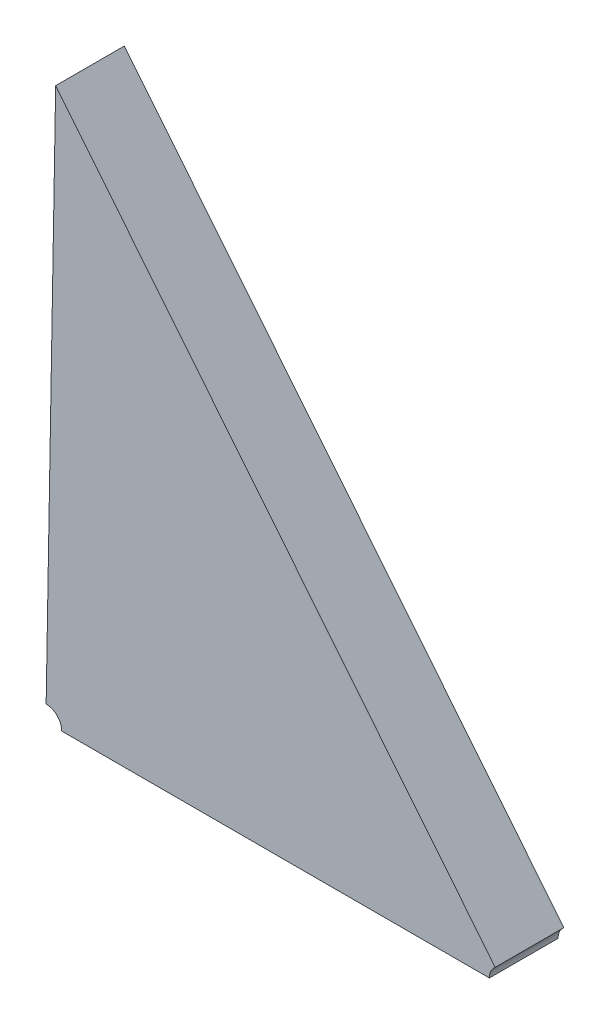
ISO-10303-21;
HEADER;
FILE_DESCRIPTION(('STEP AP214'),'2;1');
FILE_NAME('part.step','',(''),(''),'','','');
FILE_SCHEMA(('AUTOMOTIVE_DESIGN { 1 0 10303 214 1 1 1 1 }'));
ENDSEC;
DATA;
#1=APPLICATION_CONTEXT('core data for automotive mechanical design processes');
#2=APPLICATION_PROTOCOL_DEFINITION('international standard','automotive_design',2000,#1);
#3=PRODUCT_CONTEXT('',#1,'mechanical');
#4=PRODUCT('Part','Part','',(#3));
#5=PRODUCT_RELATED_PRODUCT_CATEGORY('part','',(#4));
#6=PRODUCT_DEFINITION_FORMATION('','',#4);
#7=PRODUCT_DEFINITION_CONTEXT('part definition',#1,'design');
#8=PRODUCT_DEFINITION('design','',#6,#7);
#9=PRODUCT_DEFINITION_SHAPE('','',#8);
#10=(LENGTH_UNIT() NAMED_UNIT(*) SI_UNIT(.MILLI.,.METRE.));
#11=(NAMED_UNIT(*) PLANE_ANGLE_UNIT() SI_UNIT($,.RADIAN.));
#12=(NAMED_UNIT(*) SI_UNIT($,.STERADIAN.) SOLID_ANGLE_UNIT());
#13=UNCERTAINTY_MEASURE_WITH_UNIT(LENGTH_MEASURE(1.E-05),#10,'distance_accuracy_value','');
#14=(GEOMETRIC_REPRESENTATION_CONTEXT(3) GLOBAL_UNCERTAINTY_ASSIGNED_CONTEXT((#13)) GLOBAL_UNIT_ASSIGNED_CONTEXT((#10,
#11,#12)) REPRESENTATION_CONTEXT('',''));
#15=CARTESIAN_POINT('',(0.,0.,0.));
#16=DIRECTION('',(0.,0.,1.));
#17=DIRECTION('',(1.,0.,0.));
#18=AXIS2_PLACEMENT_3D('',#15,#16,#17);
#19=CARTESIAN_POINT('',(-1.2988997607627,-1.344803661066,0.00415));
#20=DIRECTION('',(0.,0.,1.));
#21=DIRECTION('',(1.,0.,0.));
#22=AXIS2_PLACEMENT_3D('',#19,#20,#21);
#23=PLANE('',#22);
#24=DIRECTION('',(0.,-1.,0.));
#25=VECTOR('',#24,1.);
#26=CARTESIAN_POINT('',(-1.3063434907431,-1.328302967697,0.00415));
#27=LINE('',#26,#25);
#28=CARTESIAN_POINT('',(-1.3058857358849,-1.3281412097136,0.00415));
#29=VERTEX_POINT('',#28);
#30=CARTESIAN_POINT('',(-1.3063434907431,-1.3541097671065,0.00415));
#31=VERTEX_POINT('',#30);
#32=EDGE_CURVE('E11',#29,#31,#27,.T.);
#33=ORIENTED_EDGE('',*,*,#32,.T.);
#34=CARTESIAN_POINT('',(-1.3063434907431,-1.3548597671065,0.00415));
#35=DIRECTION('',(0.,0.,-1.));
#36=DIRECTION('',(-1.,0.,0.));
#37=AXIS2_PLACEMENT_3D('',#34,#35,#36);
#38=CIRCLE('',#37,0.00075);
#39=CARTESIAN_POINT('',(-1.3055934907431,-1.3548597671065,0.00415));
#40=VERTEX_POINT('',#39);
#41=EDGE_CURVE('E24',#31,#40,#38,.T.);
#42=ORIENTED_EDGE('',*,*,#41,.T.);
#43=DIRECTION('',(1.,0.,0.));
#44=VECTOR('',#43,1.);
#45=CARTESIAN_POINT('',(-1.3055934907431,-1.3548597671065,0.00415));
#46=LINE('',#45,#44);
#47=CARTESIAN_POINT('',(-1.2850407768422,-1.3548597671065,0.00415));
#48=VERTEX_POINT('',#47);
#49=EDGE_CURVE('E137',#40,#48,#46,.T.);
#50=ORIENTED_EDGE('',*,*,#49,.T.);
#51=CARTESIAN_POINT('',(-1.2842907768421,-1.3548597671065,0.00415));
#52=DIRECTION('',(0.,0.,-1.));
#53=DIRECTION('',(0.628289208450365,-0.777979865128149,0.));
#54=AXIS2_PLACEMENT_3D('',#51,#52,#53);
#55=CIRCLE('',#54,0.000749999999999999);
#56=CARTESIAN_POINT('',(-1.2847619937485,-1.3542762822077,0.00415));
#57=VERTEX_POINT('',#56);
#58=EDGE_CURVE('E77',#48,#57,#55,.T.);
#59=ORIENTED_EDGE('',*,*,#58,.T.);
#60=DIRECTION('',(-0.62828920845021,0.777979865128275,0.));
#61=VECTOR('',#60,1.);
#62=CARTESIAN_POINT('',(-1.2847619937485,-1.3542762822077,0.00415));
#63=LINE('',#62,#61);
#64=EDGE_CURVE('E134',#57,#29,#63,.T.);
#65=ORIENTED_EDGE('',*,*,#64,.T.);
#66=EDGE_LOOP('',(#33,#42,#50,#59,#65));
#67=FACE_BOUND('',#66,.T.);
#68=ADVANCED_FACE('F17',(#67),#23,.T.);
#69=CARTESIAN_POINT('',(-1.2842907768421,-1.3548597671065,0.00085));
#70=DIRECTION('',(0.777979865128275,0.628289208450209,0.));
#71=DIRECTION('',(-0.628289208450209,0.777979865128275,0.));
#72=AXIS2_PLACEMENT_3D('',#69,#70,#71);
#73=PLANE('',#72);
#74=CARTESIAN_POINT('',(-1.3058722738367,-1.32813645259576,0.00085));
#75=DIRECTION('',(0.,0.,1.));
#76=VECTOR('',#75,1.);
#77=LINE('',#74,#76);
#78=CARTESIAN_POINT('',(-1.3058857358849,-1.3281412097136,0.00085));
#79=VERTEX_POINT('',#78);
#80=EDGE_CURVE('E101',#79,#29,#77,.T.);
#81=ORIENTED_EDGE('',*,*,#80,.T.);
#82=ORIENTED_EDGE('',*,*,#64,.F.);
#83=DIRECTION('',(0.,0.,-1.));
#84=VECTOR('',#83,1.);
#85=CARTESIAN_POINT('',(-1.2847619937485,-1.3542762822077,0.00115));
#86=LINE('',#85,#84);
#87=CARTESIAN_POINT('',(-1.2847619937485,-1.3542762822077,0.00085));
#88=VERTEX_POINT('',#87);
#89=EDGE_CURVE('E99',#57,#88,#86,.T.);
#90=ORIENTED_EDGE('',*,*,#89,.T.);
#91=DIRECTION('',(-0.628289208450209,0.777979865128275,0.));
#92=VECTOR('',#91,1.);
#93=CARTESIAN_POINT('',(-1.2842907768421,-1.3548597671065,0.00085));
#94=LINE('',#93,#92);
#95=EDGE_CURVE('E83',#88,#79,#94,.T.);
#96=ORIENTED_EDGE('',*,*,#95,.T.);
#97=EDGE_LOOP('',(#81,#82,#90,#96));
#98=FACE_BOUND('',#97,.T.);
#99=ADVANCED_FACE('F116',(#98),#73,.T.);
#100=CARTESIAN_POINT('',(-1.3063434907431,-1.327552967697,0.00085));
#101=DIRECTION('',(-1.,0.,0.));
#102=DIRECTION('',(0.,-1.,0.));
#103=AXIS2_PLACEMENT_3D('',#100,#101,#102);
#104=PLANE('',#103);
#105=DIRECTION('',(0.,0.,1.));
#106=VECTOR('',#105,1.);
#107=CARTESIAN_POINT('',(-1.3063434907431,-1.3541097671065,0.00115));
#108=LINE('',#107,#106);
#109=CARTESIAN_POINT('',(-1.3063434907431,-1.3541097671065,0.00085));
#110=VERTEX_POINT('',#109);
#111=EDGE_CURVE('E94',#110,#31,#108,.T.);
#112=ORIENTED_EDGE('',*,*,#111,.T.);
#113=ORIENTED_EDGE('',*,*,#32,.F.);
#114=ORIENTED_EDGE('',*,*,#80,.F.);
#115=DIRECTION('',(0.,-1.,0.));
#116=VECTOR('',#115,1.);
#117=CARTESIAN_POINT('',(-1.3063434907431,-1.327552967697,0.00085));
#118=LINE('',#117,#116);
#119=EDGE_CURVE('E89',#79,#110,#118,.T.);
#120=ORIENTED_EDGE('',*,*,#119,.T.);
#121=EDGE_LOOP('',(#112,#113,#114,#120));
#122=FACE_BOUND('',#121,.T.);
#123=ADVANCED_FACE('F107',(#122),#104,.T.);
#124=CARTESIAN_POINT('',(-1.3063434907431,-1.3548597671065,0.00085));
#125=DIRECTION('',(0.,-1.,0.));
#126=DIRECTION('',(1.,0.,0.));
#127=AXIS2_PLACEMENT_3D('',#124,#125,#126);
#128=PLANE('',#127);
#129=DIRECTION('',(0.,0.,-1.));
#130=VECTOR('',#129,1.);
#131=CARTESIAN_POINT('',(-1.3055934907431,-1.3548597671065,0.00115));
#132=LINE('',#131,#130);
#133=CARTESIAN_POINT('',(-1.3055934907431,-1.3548597671065,0.00085));
#134=VERTEX_POINT('',#133);
#135=EDGE_CURVE('E65',#40,#134,#132,.T.);
#136=ORIENTED_EDGE('',*,*,#135,.T.);
#137=DIRECTION('',(1.,0.,0.));
#138=VECTOR('',#137,1.);
#139=CARTESIAN_POINT('',(-1.3063434907431,-1.3548597671065,0.00085));
#140=LINE('',#139,#138);
#141=CARTESIAN_POINT('',(-1.2850407768422,-1.3548597671065,0.00085));
#142=VERTEX_POINT('',#141);
#143=EDGE_CURVE('E59',#134,#142,#140,.T.);
#144=ORIENTED_EDGE('',*,*,#143,.T.);
#145=DIRECTION('',(0.,0.,1.));
#146=VECTOR('',#145,1.);
#147=CARTESIAN_POINT('',(-1.2850407768422,-1.3548597671065,0.00115));
#148=LINE('',#147,#146);
#149=EDGE_CURVE('E63',#142,#48,#148,.T.);
#150=ORIENTED_EDGE('',*,*,#149,.T.);
#151=ORIENTED_EDGE('',*,*,#49,.F.);
#152=EDGE_LOOP('',(#136,#144,#150,#151));
#153=FACE_BOUND('',#152,.T.);
#154=ADVANCED_FACE('F61',(#153),#128,.T.);
#155=CARTESIAN_POINT('',(-1.2988821065495,-1.3447713401587,0.00085));
#156=DIRECTION('',(0.,0.,1.));
#157=DIRECTION('',(1.,0.,0.));
#158=AXIS2_PLACEMENT_3D('',#155,#156,#157);
#159=PLANE('',#158);
#160=ORIENTED_EDGE('',*,*,#95,.F.);
#161=CARTESIAN_POINT('',(-1.2842907768421,-1.3548597671065,0.00085));
#162=DIRECTION('',(0.,0.,1.));
#163=DIRECTION('',(-1.,0.,0.));
#164=AXIS2_PLACEMENT_3D('',#161,#162,#163);
#165=CIRCLE('',#164,0.000749999999999999);
#166=EDGE_CURVE('E76',#88,#142,#165,.T.);
#167=ORIENTED_EDGE('',*,*,#166,.T.);
#168=ORIENTED_EDGE('',*,*,#143,.F.);
#169=CARTESIAN_POINT('',(-1.3063434907431,-1.3548597671065,0.00085));
#170=DIRECTION('',(0.,0.,1.));
#171=DIRECTION('',(-1.,0.,0.));
#172=AXIS2_PLACEMENT_3D('',#169,#170,#171);
#173=CIRCLE('',#172,0.00075);
#174=EDGE_CURVE('E84',#134,#110,#173,.T.);
#175=ORIENTED_EDGE('',*,*,#174,.T.);
#176=ORIENTED_EDGE('',*,*,#119,.F.);
#177=EDGE_LOOP('',(#160,#167,#168,#175,#176));
#178=FACE_BOUND('',#177,.T.);
#179=ADVANCED_FACE('F80',(#178),#159,.F.);
#180=CARTESIAN_POINT('',(-1.2842907768421,-1.3548597671065,0.00115));
#181=DIRECTION('',(0.,0.,1.));
#182=DIRECTION('',(-1.,0.,0.));
#183=AXIS2_PLACEMENT_3D('',#180,#181,#182);
#184=CYLINDRICAL_SURFACE('',#183,0.000749999999999999);
#185=ORIENTED_EDGE('',*,*,#89,.F.);
#186=ORIENTED_EDGE('',*,*,#58,.F.);
#187=ORIENTED_EDGE('',*,*,#149,.F.);
#188=ORIENTED_EDGE('',*,*,#166,.F.);
#189=EDGE_LOOP('',(#185,#186,#187,#188));
#190=FACE_BOUND('',#189,.T.);
#191=ADVANCED_FACE('F75',(#190),#184,.F.);
#192=CARTESIAN_POINT('',(-1.3063434907431,-1.3548597671065,0.00115));
#193=DIRECTION('',(0.,0.,1.));
#194=DIRECTION('',(-1.,0.,0.));
#195=AXIS2_PLACEMENT_3D('',#192,#193,#194);
#196=CYLINDRICAL_SURFACE('',#195,0.00075);
#197=ORIENTED_EDGE('',*,*,#111,.F.);
#198=ORIENTED_EDGE('',*,*,#174,.F.);
#199=ORIENTED_EDGE('',*,*,#135,.F.);
#200=ORIENTED_EDGE('',*,*,#41,.F.);
#201=EDGE_LOOP('',(#197,#198,#199,#200));
#202=FACE_BOUND('',#201,.T.);
#203=ADVANCED_FACE('F141',(#202),#196,.F.);
#204=CLOSED_SHELL('',(#68,#99,#123,#154,#179,#191,#203));
#205=MANIFOLD_SOLID_BREP('B1',#204);
#206=ADVANCED_BREP_SHAPE_REPRESENTATION('',(#18,#205),#14);
#207=SHAPE_DEFINITION_REPRESENTATION(#9,#206);
ENDSEC;
END-ISO-10303-21;
